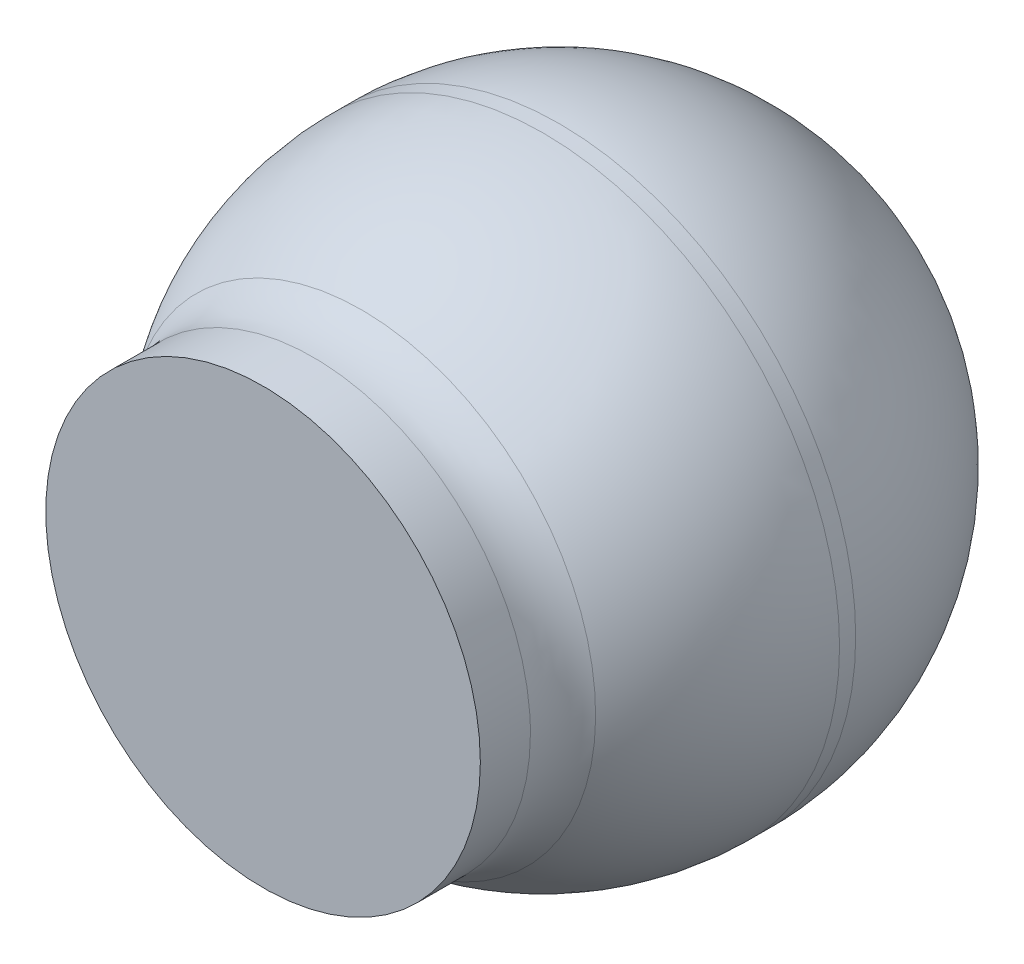
ISO-10303-21;
HEADER;
FILE_DESCRIPTION(('STEP AP214'),'2;1');
FILE_NAME('part.step','',(''),(''),'','','');
FILE_SCHEMA(('AUTOMOTIVE_DESIGN { 1 0 10303 214 1 1 1 1 }'));
ENDSEC;
DATA;
#1=APPLICATION_CONTEXT('core data for automotive mechanical design processes');
#2=APPLICATION_PROTOCOL_DEFINITION('international standard','automotive_design',2000,#1);
#3=PRODUCT_CONTEXT('',#1,'mechanical');
#4=PRODUCT('Part','Part','',(#3));
#5=PRODUCT_RELATED_PRODUCT_CATEGORY('part','',(#4));
#6=PRODUCT_DEFINITION_FORMATION('','',#4);
#7=PRODUCT_DEFINITION_CONTEXT('part definition',#1,'design');
#8=PRODUCT_DEFINITION('design','',#6,#7);
#9=PRODUCT_DEFINITION_SHAPE('','',#8);
#10=(LENGTH_UNIT() NAMED_UNIT(*) SI_UNIT(.MILLI.,.METRE.));
#11=(NAMED_UNIT(*) PLANE_ANGLE_UNIT() SI_UNIT($,.RADIAN.));
#12=(NAMED_UNIT(*) SI_UNIT($,.STERADIAN.) SOLID_ANGLE_UNIT());
#13=UNCERTAINTY_MEASURE_WITH_UNIT(LENGTH_MEASURE(1.E-05),#10,'distance_accuracy_value','');
#14=(GEOMETRIC_REPRESENTATION_CONTEXT(3) GLOBAL_UNCERTAINTY_ASSIGNED_CONTEXT((#13)) GLOBAL_UNIT_ASSIGNED_CONTEXT((#10,
#11,#12)) REPRESENTATION_CONTEXT('',''));
#15=CARTESIAN_POINT('',(0.,0.,0.));
#16=DIRECTION('',(0.,0.,1.));
#17=DIRECTION('',(1.,0.,0.));
#18=AXIS2_PLACEMENT_3D('',#15,#16,#17);
#19=CARTESIAN_POINT('',(-6.912919922269,-10.40134929145,10.006534503384));
#20=DIRECTION('',(0.,0.,-1.));
#21=DIRECTION('',(-1.,0.,0.));
#22=AXIS2_PLACEMENT_3D('',#19,#20,#21);
#23=PLANE('',#22);
#24=CARTESIAN_POINT('',(-6.912919922269,-10.40134929145,10.006534503384));
#25=DIRECTION('',(0.,0.,1.));
#26=DIRECTION('',(1.,0.,0.));
#27=AXIS2_PLACEMENT_3D('',#24,#25,#26);
#28=CIRCLE('',#27,0.275);
#29=CARTESIAN_POINT('',(-6.637919922269,-10.40134929145,10.006534503384));
#30=VERTEX_POINT('',#29);
#31=EDGE_CURVE('E20',#30,#30,#28,.F.);
#32=ORIENTED_EDGE('',*,*,#31,.F.);
#33=EDGE_LOOP('',(#32));
#34=FACE_BOUND('',#33,.T.);
#35=ADVANCED_FACE('F17',(#34),#23,.F.);
#36=CARTESIAN_POINT('',(-6.912919922269,-10.40134929145,9.906534503384));
#37=DIRECTION('',(0.,0.,1.));
#38=DIRECTION('',(1.,0.,0.));
#39=AXIS2_PLACEMENT_3D('',#36,#37,#38);
#40=CYLINDRICAL_SURFACE('',#39,0.275);
#41=CARTESIAN_POINT('',(-6.912919922269,-10.40134929145,9.943180457728));
#42=DIRECTION('',(0.,0.,-1.));
#43=DIRECTION('',(0.996700902337582,0.081162252799247,0.));
#44=AXIS2_PLACEMENT_3D('',#41,#42,#43);
#45=CIRCLE('',#44,0.275);
#46=CARTESIAN_POINT('',(-6.63882717412617,-10.3790296719302,9.943180457728));
#47=VERTEX_POINT('',#46);
#48=EDGE_CURVE('E66',#47,#47,#45,.F.);
#49=ORIENTED_EDGE('',*,*,#48,.T.);
#50=EDGE_LOOP('',(#49));
#51=FACE_BOUND('',#50,.T.);
#52=ORIENTED_EDGE('',*,*,#31,.T.);
#53=EDGE_LOOP('',(#52));
#54=FACE_BOUND('',#53,.T.);
#55=ADVANCED_FACE('F62',(#51,#54),#40,.T.);
#56=CARTESIAN_POINT('',(-6.912919922269,-10.40134929145,9.943180457728));
#57=DIRECTION('',(0.,0.,-1.));
#58=DIRECTION('',(0.996700902337583,0.0811622527992448,0.));
#59=AXIS2_PLACEMENT_3D('',#56,#57,#58);
#60=TOROIDAL_SURFACE('',#59,0.375,0.1);
#61=ORIENTED_EDGE('',*,*,#48,.F.);
#62=EDGE_LOOP('',(#61));
#63=FACE_BOUND('',#62,.T.);
#64=CARTESIAN_POINT('',(-6.912919922269,-10.40134929145,9.881744931236));
#65=DIRECTION('',(0.,0.,-1.));
#66=DIRECTION('',(-0.99670090233869,-0.0811622527856412,0.));
#67=AXIS2_PLACEMENT_3D('',#64,#65,#66);
#68=CIRCLE('',#67,0.29609704641234);
#69=CARTESIAN_POINT('',(-7.208040115608,-10.42538119478,9.881744931236));
#70=VERTEX_POINT('',#69);
#71=EDGE_CURVE('E39',#70,#70,#68,.T.);
#72=ORIENTED_EDGE('',*,*,#71,.F.);
#73=EDGE_LOOP('',(#72));
#74=FACE_BOUND('',#73,.T.);
#75=ADVANCED_FACE('F57',(#63,#74),#60,.F.);
#76=CARTESIAN_POINT('',(-7.286682760645,-10.43178513625,9.651976062157));
#77=CARTESIAN_POINT('',(-7.286682760645,-10.43178513625,9.701461392103));
#78=CARTESIAN_POINT('',(-7.278526217348,-10.43112094157,9.750947004335));
#79=CARTESIAN_POINT('',(-7.262207085349,-10.42979205995,9.798626332798));
#80=CARTESIAN_POINT('',(-7.238341390838,-10.42784865493,9.842699544317));
#81=CARTESIAN_POINT('',(-7.208040115608,-10.42538119478,9.881744931236));
#82=(BOUNDED_CURVE() B_SPLINE_CURVE(5,(#76,#77,#78,#79,#80,#81),.UNSPECIFIED.,.F.,
.F.) B_SPLINE_CURVE_WITH_KNOTS((6,6),(0.,0.661568582165),
.UNSPECIFIED.) CURVE() GEOMETRIC_REPRESENTATION_ITEM() RATIONAL_B_SPLINE_CURVE((1.,1.,1.,1.,1.,1.)) REPRESENTATION_ITEM(''));
#83=CARTESIAN_POINT('',(-6.912919922269,-10.40134929145,9.651976062157));
#84=DIRECTION('',(0.,0.,-1.));
#85=AXIS1_PLACEMENT('',#83,#84);
#86=SURFACE_OF_REVOLUTION('',#82,#85);
#87=CARTESIAN_POINT('',(-6.912919922269,-10.40134929145,9.651976062157));
#88=DIRECTION('',(0.,0.,1.));
#89=DIRECTION('',(1.,0.,0.));
#90=AXIS2_PLACEMENT_3D('',#87,#88,#89);
#91=CIRCLE('',#90,0.375);
#92=CARTESIAN_POINT('',(-6.537919922269,-10.40134929145,9.651976062157));
#93=VERTEX_POINT('',#92);
#94=EDGE_CURVE('E36',#93,#93,#91,.F.);
#95=ORIENTED_EDGE('',*,*,#94,.F.);
#96=EDGE_LOOP('',(#95));
#97=FACE_BOUND('',#96,.T.);
#98=ORIENTED_EDGE('',*,*,#71,.T.);
#99=EDGE_LOOP('',(#98));
#100=FACE_BOUND('',#99,.T.);
#101=ADVANCED_FACE('F53',(#97,#100),#86,.F.);
#102=CARTESIAN_POINT('',(-6.912919922269,-10.40134929145,9.256534503384));
#103=DIRECTION('',(0.,0.,1.));
#104=DIRECTION('',(1.,0.,0.));
#105=AXIS2_PLACEMENT_3D('',#102,#103,#104);
#106=CYLINDRICAL_SURFACE('',#105,0.375);
#107=CARTESIAN_POINT('',(-6.912919922269,-10.40134929145,9.631534503384));
#108=DIRECTION('',(0.,0.,-1.));
#109=DIRECTION('',(0.0811622527992357,-0.996700902337583,0.));
#110=AXIS2_PLACEMENT_3D('',#107,#108,#109);
#111=CIRCLE('',#110,0.375);
#112=CARTESIAN_POINT('',(-6.88248407746929,-10.7751121298266,9.631534503384));
#113=VERTEX_POINT('',#112);
#114=CARTESIAN_POINT('',(-6.94335576706871,-10.0275864530734,9.631534503384));
#115=VERTEX_POINT('',#114);
#116=EDGE_CURVE('E11',#113,#115,#111,.T.);
#117=ORIENTED_EDGE('',*,*,#116,.F.);
#118=CARTESIAN_POINT('',(-6.912919922269,-10.40134929145,9.631534503384));
#119=DIRECTION('',(3.33436315446763E-12,2.72100352061447E-13,1.));
#120=DIRECTION('',(0.0811622527992365,-0.996700902337583,0.));
#121=AXIS2_PLACEMENT_3D('',#118,#119,#120);
#122=CIRCLE('',#121,0.375);
#123=EDGE_CURVE('E25',#115,#113,#122,.F.);
#124=ORIENTED_EDGE('',*,*,#123,.F.);
#125=EDGE_LOOP('',(#117,#124));
#126=FACE_BOUND('',#125,.T.);
#127=ORIENTED_EDGE('',*,*,#94,.T.);
#128=EDGE_LOOP('',(#127));
#129=FACE_BOUND('',#128,.T.);
#130=ADVANCED_FACE('F34',(#126,#129),#106,.T.);
#131=CARTESIAN_POINT('',(-6.912919922269,-10.40134929145,9.631534503384));
#132=DIRECTION('',(0.0811622527992361,-0.996700902337583,0.));
#133=DIRECTION('',(-0.996700902337583,-0.0811622527992361,0.));
#134=AXIS2_PLACEMENT_3D('',#131,#132,#133);
#135=SPHERICAL_SURFACE('',#134,0.375);
#136=ORIENTED_EDGE('',*,*,#123,.T.);
#137=ORIENTED_EDGE('',*,*,#116,.T.);
#138=EDGE_LOOP('',(#136,#137));
#139=FACE_BOUND('',#138,.T.);
#140=ADVANCED_FACE('F32',(#139),#135,.T.);
#141=CLOSED_SHELL('',(#35,#55,#75,#101,#130,#140));
#142=MANIFOLD_SOLID_BREP('B1',#141);
#143=ADVANCED_BREP_SHAPE_REPRESENTATION('',(#18,#142),#14);
#144=SHAPE_DEFINITION_REPRESENTATION(#9,#143);
ENDSEC;
END-ISO-10303-21;
